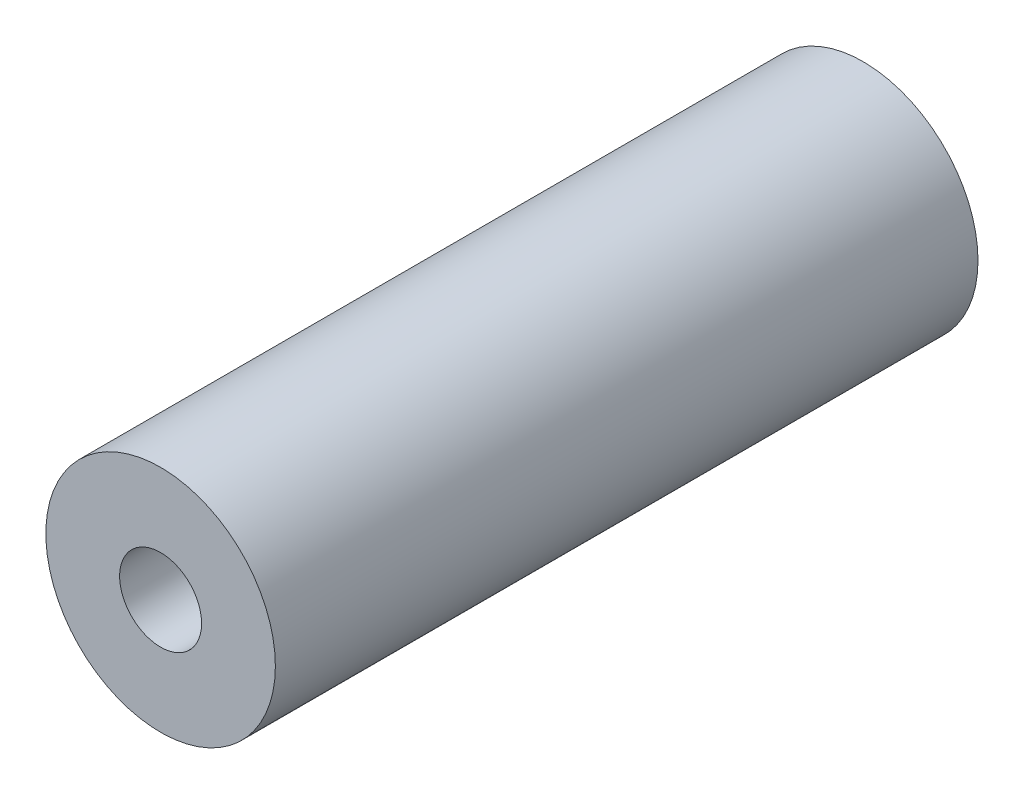
ISO-10303-21;
HEADER;
FILE_DESCRIPTION(('STEP AP214'),'2;1');
FILE_NAME('part.step','',(''),(''),'','','');
FILE_SCHEMA(('AUTOMOTIVE_DESIGN { 1 0 10303 214 1 1 1 1 }'));
ENDSEC;
DATA;
#1=APPLICATION_CONTEXT('core data for automotive mechanical design processes');
#2=APPLICATION_PROTOCOL_DEFINITION('international standard','automotive_design',2000,#1);
#3=PRODUCT_CONTEXT('',#1,'mechanical');
#4=PRODUCT('Part','Part','',(#3));
#5=PRODUCT_RELATED_PRODUCT_CATEGORY('part','',(#4));
#6=PRODUCT_DEFINITION_FORMATION('','',#4);
#7=PRODUCT_DEFINITION_CONTEXT('part definition',#1,'design');
#8=PRODUCT_DEFINITION('design','',#6,#7);
#9=PRODUCT_DEFINITION_SHAPE('','',#8);
#10=(LENGTH_UNIT() NAMED_UNIT(*) SI_UNIT(.MILLI.,.METRE.));
#11=(NAMED_UNIT(*) PLANE_ANGLE_UNIT() SI_UNIT($,.RADIAN.));
#12=(NAMED_UNIT(*) SI_UNIT($,.STERADIAN.) SOLID_ANGLE_UNIT());
#13=UNCERTAINTY_MEASURE_WITH_UNIT(LENGTH_MEASURE(1.E-05),#10,'distance_accuracy_value','');
#14=(GEOMETRIC_REPRESENTATION_CONTEXT(3) GLOBAL_UNCERTAINTY_ASSIGNED_CONTEXT((#13)) GLOBAL_UNIT_ASSIGNED_CONTEXT((#10,
#11,#12)) REPRESENTATION_CONTEXT('',''));
#15=CARTESIAN_POINT('',(0.,0.,0.));
#16=DIRECTION('',(0.,0.,1.));
#17=DIRECTION('',(1.,0.,0.));
#18=AXIS2_PLACEMENT_3D('',#15,#16,#17);
#19=CARTESIAN_POINT('',(0.,0.,30.));
#20=DIRECTION('',(0.,0.,1.));
#21=DIRECTION('',(1.,0.,0.));
#22=AXIS2_PLACEMENT_3D('',#19,#20,#21);
#23=PLANE('',#22);
#24=CARTESIAN_POINT('',(0.,0.,30.));
#25=DIRECTION('',(0.,0.,1.));
#26=DIRECTION('',(1.,0.,0.));
#27=AXIS2_PLACEMENT_3D('',#24,#25,#26);
#28=CIRCLE('',#27,4.9);
#29=CARTESIAN_POINT('',(4.9,0.,30.));
#30=VERTEX_POINT('',#29);
#31=EDGE_CURVE('E10',#30,#30,#28,.T.);
#32=ORIENTED_EDGE('',*,*,#31,.T.);
#33=EDGE_LOOP('',(#32));
#34=FACE_BOUND('',#33,.T.);
#35=CARTESIAN_POINT('',(0.,0.,30.));
#36=DIRECTION('',(0.,0.,1.));
#37=DIRECTION('',(1.,0.,0.));
#38=AXIS2_PLACEMENT_3D('',#35,#36,#37);
#39=CIRCLE('',#38,1.75);
#40=CARTESIAN_POINT('',(1.75,0.,30.));
#41=VERTEX_POINT('',#40);
#42=EDGE_CURVE('E42',#41,#41,#39,.T.);
#43=ORIENTED_EDGE('',*,*,#42,.F.);
#44=EDGE_LOOP('',(#43));
#45=FACE_BOUND('',#44,.T.);
#46=ADVANCED_FACE('F31',(#34,#45),#23,.T.);
#47=CARTESIAN_POINT('',(0.,0.,0.));
#48=DIRECTION('',(0.,0.,1.));
#49=DIRECTION('',(1.,0.,0.));
#50=AXIS2_PLACEMENT_3D('',#47,#48,#49);
#51=PLANE('',#50);
#52=CARTESIAN_POINT('',(0.,0.,0.));
#53=DIRECTION('',(0.,0.,1.));
#54=DIRECTION('',(1.,0.,0.));
#55=AXIS2_PLACEMENT_3D('',#52,#53,#54);
#56=CIRCLE('',#55,4.9);
#57=CARTESIAN_POINT('',(4.9,0.,0.));
#58=VERTEX_POINT('',#57);
#59=EDGE_CURVE('E35',#58,#58,#56,.T.);
#60=ORIENTED_EDGE('',*,*,#59,.F.);
#61=EDGE_LOOP('',(#60));
#62=FACE_BOUND('',#61,.T.);
#63=CARTESIAN_POINT('',(0.,0.,0.));
#64=DIRECTION('',(0.,0.,1.));
#65=DIRECTION('',(1.,0.,0.));
#66=AXIS2_PLACEMENT_3D('',#63,#64,#65);
#67=CIRCLE('',#66,1.75);
#68=CARTESIAN_POINT('',(1.75,0.,0.));
#69=VERTEX_POINT('',#68);
#70=EDGE_CURVE('E44',#69,#69,#67,.T.);
#71=ORIENTED_EDGE('',*,*,#70,.T.);
#72=EDGE_LOOP('',(#71));
#73=FACE_BOUND('',#72,.T.);
#74=ADVANCED_FACE('F54',(#62,#73),#51,.F.);
#75=CARTESIAN_POINT('',(0.,0.,30.));
#76=DIRECTION('',(0.,0.,-1.));
#77=DIRECTION('',(-1.,0.,0.));
#78=AXIS2_PLACEMENT_3D('',#75,#76,#77);
#79=CYLINDRICAL_SURFACE('',#78,4.9);
#80=ORIENTED_EDGE('',*,*,#31,.F.);
#81=EDGE_LOOP('',(#80));
#82=FACE_BOUND('',#81,.T.);
#83=ORIENTED_EDGE('',*,*,#59,.T.);
#84=EDGE_LOOP('',(#83));
#85=FACE_BOUND('',#84,.T.);
#86=ADVANCED_FACE('F33',(#82,#85),#79,.T.);
#87=CARTESIAN_POINT('',(0.,0.,30.));
#88=DIRECTION('',(0.,0.,-1.));
#89=DIRECTION('',(-1.,0.,0.));
#90=AXIS2_PLACEMENT_3D('',#87,#88,#89);
#91=CYLINDRICAL_SURFACE('',#90,1.75);
#92=ORIENTED_EDGE('',*,*,#42,.T.);
#93=EDGE_LOOP('',(#92));
#94=FACE_BOUND('',#93,.T.);
#95=ORIENTED_EDGE('',*,*,#70,.F.);
#96=EDGE_LOOP('',(#95));
#97=FACE_BOUND('',#96,.T.);
#98=ADVANCED_FACE('F50',(#94,#97),#91,.F.);
#99=CLOSED_SHELL('',(#46,#74,#86,#98));
#100=MANIFOLD_SOLID_BREP('B2',#99);
#101=ADVANCED_BREP_SHAPE_REPRESENTATION('',(#18,#100),#14);
#102=SHAPE_DEFINITION_REPRESENTATION(#9,#101);
ENDSEC;
END-ISO-10303-21;
